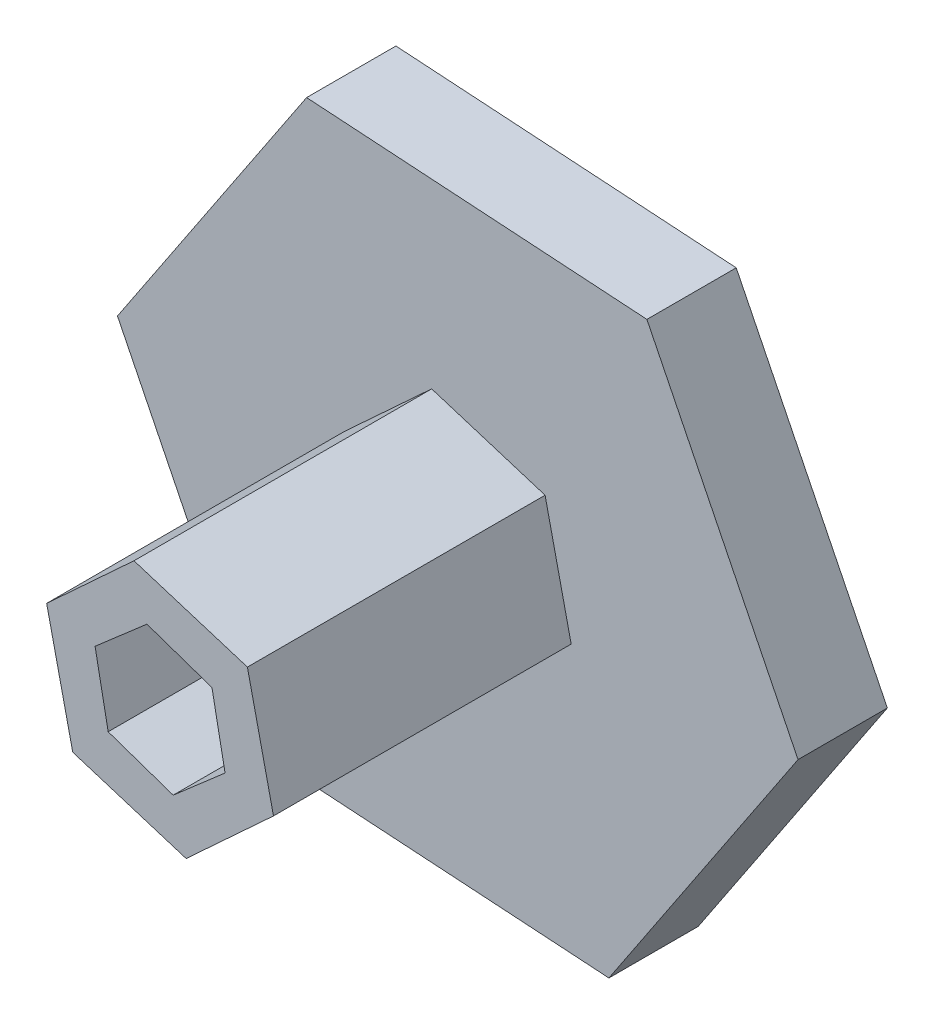
ISO-10303-21;
HEADER;
FILE_DESCRIPTION(('STEP AP214'),'2;1');
FILE_NAME('part.step','',(''),(''),'','','');
FILE_SCHEMA(('AUTOMOTIVE_DESIGN { 1 0 10303 214 1 1 1 1 }'));
ENDSEC;
DATA;
#1=APPLICATION_CONTEXT('core data for automotive mechanical design processes');
#2=APPLICATION_PROTOCOL_DEFINITION('international standard','automotive_design',2000,#1);
#3=PRODUCT_CONTEXT('',#1,'mechanical');
#4=PRODUCT('Part','Part','',(#3));
#5=PRODUCT_RELATED_PRODUCT_CATEGORY('part','',(#4));
#6=PRODUCT_DEFINITION_FORMATION('','',#4);
#7=PRODUCT_DEFINITION_CONTEXT('part definition',#1,'design');
#8=PRODUCT_DEFINITION('design','',#6,#7);
#9=PRODUCT_DEFINITION_SHAPE('','',#8);
#10=(LENGTH_UNIT() NAMED_UNIT(*) SI_UNIT(.MILLI.,.METRE.));
#11=(NAMED_UNIT(*) PLANE_ANGLE_UNIT() SI_UNIT($,.RADIAN.));
#12=(NAMED_UNIT(*) SI_UNIT($,.STERADIAN.) SOLID_ANGLE_UNIT());
#13=UNCERTAINTY_MEASURE_WITH_UNIT(LENGTH_MEASURE(1.E-05),#10,'distance_accuracy_value','');
#14=(GEOMETRIC_REPRESENTATION_CONTEXT(3) GLOBAL_UNCERTAINTY_ASSIGNED_CONTEXT((#13)) GLOBAL_UNIT_ASSIGNED_CONTEXT((#10,
#11,#12)) REPRESENTATION_CONTEXT('',''));
#15=CARTESIAN_POINT('',(0.,0.,0.));
#16=DIRECTION('',(0.,0.,1.));
#17=DIRECTION('',(1.,0.,0.));
#18=AXIS2_PLACEMENT_3D('',#15,#16,#17);
#19=CARTESIAN_POINT('',(4.98689864421293,0.968112551487275,-7.62));
#20=DIRECTION('',(0.981672961459239,0.190573336906944,0.));
#21=DIRECTION('',(-0.190573336906944,0.981672961459239,0.));
#22=AXIS2_PLACEMENT_3D('',#19,#20,#21);
#23=PLANE('',#22);
#24=DIRECTION('',(0.190573336906933,-0.981672961459241,0.));
#25=VECTOR('',#24,1.);
#26=CARTESIAN_POINT('',(4.42795860200594,3.84729982614494,0.));
#27=LINE('',#26,#25);
#28=CARTESIAN_POINT('',(4.4279586020059,3.84729982614499,0.));
#29=VERTEX_POINT('',#28);
#30=CARTESIAN_POINT('',(5.54583868641994,-1.9110747231705,0.));
#31=VERTEX_POINT('',#30);
#32=EDGE_CURVE('E182',#29,#31,#27,.T.);
#33=ORIENTED_EDGE('',*,*,#32,.T.);
#34=DIRECTION('',(0.,0.,1.));
#35=VECTOR('',#34,1.);
#36=CARTESIAN_POINT('',(5.54583868641997,-1.91107472317044,-7.62));
#37=LINE('',#36,#35);
#38=CARTESIAN_POINT('',(5.54583868641997,-1.91107472317044,25.4));
#39=VERTEX_POINT('',#38);
#40=EDGE_CURVE('E166',#31,#39,#37,.T.);
#41=ORIENTED_EDGE('',*,*,#40,.T.);
#42=DIRECTION('',(-0.190573336906944,0.981672961459239,0.));
#43=VECTOR('',#42,1.);
#44=CARTESIAN_POINT('',(4.98689864421293,0.968112551487275,25.4));
#45=LINE('',#44,#43);
#46=CARTESIAN_POINT('',(4.4279586020059,3.84729982614499,25.4));
#47=VERTEX_POINT('',#46);
#48=EDGE_CURVE('E200',#39,#47,#45,.T.);
#49=ORIENTED_EDGE('',*,*,#48,.T.);
#50=DIRECTION('',(0.,0.,1.));
#51=VECTOR('',#50,1.);
#52=CARTESIAN_POINT('',(4.4279586020059,3.84729982614499,-7.62));
#53=LINE('',#52,#51);
#54=EDGE_CURVE('E183',#29,#47,#53,.T.);
#55=ORIENTED_EDGE('',*,*,#54,.F.);
#56=EDGE_LOOP('',(#33,#41,#49,#55));
#57=FACE_BOUND('',#56,.T.);
#58=ADVANCED_FACE('F39',(#57),#23,.F.);
#59=CARTESIAN_POINT('',(1.65503925879592,4.80283718773021,-7.62));
#60=DIRECTION('',(0.325795129684236,0.945440391285475,0.));
#61=DIRECTION('',(-0.945440391285475,0.325795129684236,0.));
#62=AXIS2_PLACEMENT_3D('',#59,#60,#61);
#63=PLANE('',#62);
#64=DIRECTION('',(0.945440391285471,-0.325795129684245,0.));
#65=VECTOR('',#64,1.);
#66=CARTESIAN_POINT('',(-1.11788008441401,5.75837454931544,0.));
#67=LINE('',#66,#65);
#68=CARTESIAN_POINT('',(-1.11788008441407,5.75837454931544,0.));
#69=VERTEX_POINT('',#68);
#70=EDGE_CURVE('E57',#69,#29,#67,.T.);
#71=ORIENTED_EDGE('',*,*,#70,.T.);
#72=ORIENTED_EDGE('',*,*,#54,.T.);
#73=DIRECTION('',(-0.945440391285475,0.325795129684236,0.));
#74=VECTOR('',#73,1.);
#75=CARTESIAN_POINT('',(1.65503925879592,4.80283718773021,25.4));
#76=LINE('',#75,#74);
#77=CARTESIAN_POINT('',(-1.11788008441407,5.75837454931544,25.4));
#78=VERTEX_POINT('',#77);
#79=EDGE_CURVE('E217',#47,#78,#76,.T.);
#80=ORIENTED_EDGE('',*,*,#79,.T.);
#81=DIRECTION('',(0.,0.,1.));
#82=VECTOR('',#81,1.);
#83=CARTESIAN_POINT('',(-1.11788008441407,5.75837454931544,-7.62));
#84=LINE('',#83,#82);
#85=EDGE_CURVE('E265',#69,#78,#84,.T.);
#86=ORIENTED_EDGE('',*,*,#85,.F.);
#87=EDGE_LOOP('',(#71,#72,#80,#86));
#88=FACE_BOUND('',#87,.T.);
#89=ADVANCED_FACE('F393',(#88),#63,.F.);
#90=CARTESIAN_POINT('',(-3.33185938541702,3.83472463624293,-7.62));
#91=DIRECTION('',(-0.655877831775004,0.754867054378531,0.));
#92=DIRECTION('',(-0.754867054378531,-0.655877831775004,0.));
#93=AXIS2_PLACEMENT_3D('',#90,#91,#92);
#94=PLANE('',#93);
#95=DIRECTION('',(0.754867054378538,0.655877831774995,0.));
#96=VECTOR('',#95,1.);
#97=CARTESIAN_POINT('',(-5.54583868641995,1.9110747231705,0.));
#98=LINE('',#97,#96);
#99=CARTESIAN_POINT('',(-5.54583868641997,1.91107472317044,0.));
#100=VERTEX_POINT('',#99);
#101=EDGE_CURVE('E65',#100,#69,#98,.T.);
#102=ORIENTED_EDGE('',*,*,#101,.T.);
#103=ORIENTED_EDGE('',*,*,#85,.T.);
#104=DIRECTION('',(-0.754867054378531,-0.655877831775004,0.));
#105=VECTOR('',#104,1.);
#106=CARTESIAN_POINT('',(-3.33185938541702,3.83472463624293,25.4));
#107=LINE('',#106,#105);
#108=CARTESIAN_POINT('',(-5.54583868641997,1.91107472317044,25.4));
#109=VERTEX_POINT('',#108);
#110=EDGE_CURVE('E213',#78,#109,#107,.T.);
#111=ORIENTED_EDGE('',*,*,#110,.T.);
#112=DIRECTION('',(0.,0.,1.));
#113=VECTOR('',#112,1.);
#114=CARTESIAN_POINT('',(-5.54583868641997,1.91107472317044,-7.62));
#115=LINE('',#114,#113);
#116=EDGE_CURVE('E268',#100,#109,#115,.T.);
#117=ORIENTED_EDGE('',*,*,#116,.F.);
#118=EDGE_LOOP('',(#102,#103,#111,#117));
#119=FACE_BOUND('',#118,.T.);
#120=ADVANCED_FACE('F398',(#119),#94,.F.);
#121=CARTESIAN_POINT('',(-4.98689864421293,-0.968112551487275,-7.62));
#122=DIRECTION('',(-0.981672961459239,-0.190573336906944,0.));
#123=DIRECTION('',(0.190573336906944,-0.981672961459239,0.));
#124=AXIS2_PLACEMENT_3D('',#121,#122,#123);
#125=PLANE('',#124);
#126=DIRECTION('',(-0.190573336906933,0.981672961459241,0.));
#127=VECTOR('',#126,1.);
#128=CARTESIAN_POINT('',(-4.42795860200594,-3.84729982614495,0.));
#129=LINE('',#128,#127);
#130=CARTESIAN_POINT('',(-4.4279586020059,-3.84729982614499,0.));
#131=VERTEX_POINT('',#130);
#132=EDGE_CURVE('E194',#131,#100,#129,.T.);
#133=ORIENTED_EDGE('',*,*,#132,.T.);
#134=ORIENTED_EDGE('',*,*,#116,.T.);
#135=DIRECTION('',(0.190573336906944,-0.981672961459239,0.));
#136=VECTOR('',#135,1.);
#137=CARTESIAN_POINT('',(-4.98689864421293,-0.968112551487275,25.4));
#138=LINE('',#137,#136);
#139=CARTESIAN_POINT('',(-4.4279586020059,-3.84729982614499,25.4));
#140=VERTEX_POINT('',#139);
#141=EDGE_CURVE('E209',#109,#140,#138,.T.);
#142=ORIENTED_EDGE('',*,*,#141,.T.);
#143=DIRECTION('',(0.,0.,1.));
#144=VECTOR('',#143,1.);
#145=CARTESIAN_POINT('',(-4.4279586020059,-3.84729982614499,-7.62));
#146=LINE('',#145,#144);
#147=EDGE_CURVE('E271',#131,#140,#146,.T.);
#148=ORIENTED_EDGE('',*,*,#147,.F.);
#149=EDGE_LOOP('',(#133,#134,#142,#148));
#150=FACE_BOUND('',#149,.T.);
#151=ADVANCED_FACE('F449',(#150),#125,.F.);
#152=CARTESIAN_POINT('',(-1.65503925879592,-4.80283718773021,-7.62));
#153=DIRECTION('',(-0.325795129684235,-0.945440391285475,0.));
#154=DIRECTION('',(0.945440391285475,-0.325795129684235,0.));
#155=AXIS2_PLACEMENT_3D('',#152,#153,#154);
#156=PLANE('',#155);
#157=DIRECTION('',(-0.945440391285472,0.325795129684246,0.));
#158=VECTOR('',#157,1.);
#159=CARTESIAN_POINT('',(1.117880084414,-5.75837454931544,0.));
#160=LINE('',#159,#158);
#161=CARTESIAN_POINT('',(1.11788008441407,-5.75837454931544,0.));
#162=VERTEX_POINT('',#161);
#163=EDGE_CURVE('E190',#162,#131,#160,.T.);
#164=ORIENTED_EDGE('',*,*,#163,.T.);
#165=ORIENTED_EDGE('',*,*,#147,.T.);
#166=DIRECTION('',(0.945440391285475,-0.325795129684235,0.));
#167=VECTOR('',#166,1.);
#168=CARTESIAN_POINT('',(-1.65503925879592,-4.80283718773021,25.4));
#169=LINE('',#168,#167);
#170=CARTESIAN_POINT('',(1.11788008441407,-5.75837454931544,25.4));
#171=VERTEX_POINT('',#170);
#172=EDGE_CURVE('E205',#140,#171,#169,.T.);
#173=ORIENTED_EDGE('',*,*,#172,.T.);
#174=DIRECTION('',(0.,0.,1.));
#175=VECTOR('',#174,1.);
#176=CARTESIAN_POINT('',(1.11788008441407,-5.75837454931544,-7.62));
#177=LINE('',#176,#175);
#178=EDGE_CURVE('E178',#162,#171,#177,.T.);
#179=ORIENTED_EDGE('',*,*,#178,.F.);
#180=EDGE_LOOP('',(#164,#165,#173,#179));
#181=FACE_BOUND('',#180,.T.);
#182=ADVANCED_FACE('F451',(#181),#156,.F.);
#183=CARTESIAN_POINT('',(3.33185938541702,-3.83472463624294,-7.62));
#184=DIRECTION('',(0.655877831775004,-0.754867054378531,0.));
#185=DIRECTION('',(0.754867054378531,0.655877831775004,0.));
#186=AXIS2_PLACEMENT_3D('',#183,#184,#185);
#187=PLANE('',#186);
#188=DIRECTION('',(-0.754867054378538,-0.655877831774995,0.));
#189=VECTOR('',#188,1.);
#190=CARTESIAN_POINT('',(5.54583868641994,-1.9110747231705,0.));
#191=LINE('',#190,#189);
#192=EDGE_CURVE('E170',#31,#162,#191,.T.);
#193=ORIENTED_EDGE('',*,*,#192,.T.);
#194=ORIENTED_EDGE('',*,*,#178,.T.);
#195=DIRECTION('',(0.754867054378531,0.655877831775004,0.));
#196=VECTOR('',#195,1.);
#197=CARTESIAN_POINT('',(3.33185938541702,-3.83472463624294,25.4));
#198=LINE('',#197,#196);
#199=EDGE_CURVE('E173',#171,#39,#198,.T.);
#200=ORIENTED_EDGE('',*,*,#199,.T.);
#201=ORIENTED_EDGE('',*,*,#40,.F.);
#202=EDGE_LOOP('',(#193,#194,#200,#201));
#203=FACE_BOUND('',#202,.T.);
#204=ADVANCED_FACE('F168',(#203),#187,.F.);
#205=CARTESIAN_POINT('',(20.9652843551368,-13.9768562367577,-7.62));
#206=DIRECTION('',(0.832050294337847,-0.554700196225225,0.));
#207=DIRECTION('',(0.554700196225225,0.832050294337847,0.));
#208=AXIS2_PLACEMENT_3D('',#205,#206,#207);
#209=PLANE('',#208);
#210=DIRECTION('',(0.554700196225225,0.832050294337847,0.));
#211=VECTOR('',#210,1.);
#212=CARTESIAN_POINT('',(20.9652843551368,-13.9768562367577,0.));
#213=LINE('',#212,#211);
#214=CARTESIAN_POINT('',(12.8957426444201,-26.081168802833,0.));
#215=VERTEX_POINT('',#214);
#216=CARTESIAN_POINT('',(29.0348260658536,-1.87254367068243,0.));
#217=VERTEX_POINT('',#216);
#218=EDGE_CURVE('E324',#215,#217,#213,.T.);
#219=ORIENTED_EDGE('',*,*,#218,.F.);
#220=DIRECTION('',(0.,0.,1.));
#221=VECTOR('',#220,1.);
#222=CARTESIAN_POINT('',(12.8957426444201,-26.081168802833,-7.62));
#223=LINE('',#222,#221);
#224=CARTESIAN_POINT('',(12.8957426444201,-26.081168802833,-7.62));
#225=VERTEX_POINT('',#224);
#226=EDGE_CURVE('E11',#225,#215,#223,.T.);
#227=ORIENTED_EDGE('',*,*,#226,.F.);
#228=DIRECTION('',(0.554700196225225,0.832050294337847,0.));
#229=VECTOR('',#228,1.);
#230=CARTESIAN_POINT('',(20.9652843551368,-13.9768562367577,-7.62));
#231=LINE('',#230,#229);
#232=CARTESIAN_POINT('',(29.0348260658536,-1.87254367068243,-7.62));
#233=VERTEX_POINT('',#232);
#234=EDGE_CURVE('E276',#225,#233,#231,.T.);
#235=ORIENTED_EDGE('',*,*,#234,.T.);
#236=DIRECTION('',(0.,0.,1.));
#237=VECTOR('',#236,1.);
#238=CARTESIAN_POINT('',(29.0348260658536,-1.87254367068243,-7.62));
#239=LINE('',#238,#237);
#240=EDGE_CURVE('E43',#233,#217,#239,.T.);
#241=ORIENTED_EDGE('',*,*,#240,.T.);
#242=EDGE_LOOP('',(#219,#227,#235,#241));
#243=FACE_BOUND('',#242,.T.);
#244=ADVANCED_FACE('F41',(#243),#209,.T.);
#245=CARTESIAN_POINT('',(-1.62167038850674,-25.1448969674918,-7.62));
#246=DIRECTION('',(-0.0643593142463341,-0.997926790235507,0.));
#247=DIRECTION('',(0.997926790235507,-0.0643593142463341,0.));
#248=AXIS2_PLACEMENT_3D('',#245,#246,#247);
#249=PLANE('',#248);
#250=DIRECTION('',(0.997926790235507,-0.064359314246334,0.));
#251=VECTOR('',#250,1.);
#252=CARTESIAN_POINT('',(-1.62167038850674,-25.1448969674918,0.));
#253=LINE('',#252,#251);
#254=CARTESIAN_POINT('',(-16.1390834214335,-24.2086251321506,0.));
#255=VERTEX_POINT('',#254);
#256=EDGE_CURVE('E281',#255,#215,#253,.T.);
#257=ORIENTED_EDGE('',*,*,#256,.F.);
#258=DIRECTION('',(0.,0.,1.));
#259=VECTOR('',#258,1.);
#260=CARTESIAN_POINT('',(-16.1390834214335,-24.2086251321506,-7.62));
#261=LINE('',#260,#259);
#262=CARTESIAN_POINT('',(-16.1390834214335,-24.2086251321506,-7.62));
#263=VERTEX_POINT('',#262);
#264=EDGE_CURVE('E49',#263,#255,#261,.T.);
#265=ORIENTED_EDGE('',*,*,#264,.F.);
#266=DIRECTION('',(0.997926790235507,-0.064359314246334,0.));
#267=VECTOR('',#266,1.);
#268=CARTESIAN_POINT('',(-1.62167038850674,-25.1448969674918,-7.62));
#269=LINE('',#268,#267);
#270=EDGE_CURVE('E297',#263,#225,#269,.T.);
#271=ORIENTED_EDGE('',*,*,#270,.T.);
#272=ORIENTED_EDGE('',*,*,#226,.T.);
#273=EDGE_LOOP('',(#257,#265,#271,#272));
#274=FACE_BOUND('',#273,.T.);
#275=ADVANCED_FACE('F370',(#274),#249,.T.);
#276=CARTESIAN_POINT('',(-22.5869547436436,-11.1680407307341,-7.62));
#277=DIRECTION('',(-0.896409608584181,-0.443226594010282,0.));
#278=DIRECTION('',(0.443226594010282,-0.896409608584181,0.));
#279=AXIS2_PLACEMENT_3D('',#276,#277,#278);
#280=PLANE('',#279);
#281=DIRECTION('',(0.443226594010282,-0.896409608584181,0.));
#282=VECTOR('',#281,1.);
#283=CARTESIAN_POINT('',(-22.5869547436436,-11.1680407307341,0.));
#284=LINE('',#283,#282);
#285=CARTESIAN_POINT('',(-29.0348260658536,1.87254367068243,0.));
#286=VERTEX_POINT('',#285);
#287=EDGE_CURVE('E340',#286,#255,#284,.T.);
#288=ORIENTED_EDGE('',*,*,#287,.F.);
#289=DIRECTION('',(0.,0.,1.));
#290=VECTOR('',#289,1.);
#291=CARTESIAN_POINT('',(-29.0348260658536,1.87254367068243,-7.62));
#292=LINE('',#291,#290);
#293=CARTESIAN_POINT('',(-29.0348260658536,1.87254367068243,-7.62));
#294=VERTEX_POINT('',#293);
#295=EDGE_CURVE('E349',#294,#286,#292,.T.);
#296=ORIENTED_EDGE('',*,*,#295,.F.);
#297=DIRECTION('',(0.443226594010282,-0.896409608584181,0.));
#298=VECTOR('',#297,1.);
#299=CARTESIAN_POINT('',(-22.5869547436436,-11.1680407307341,-7.62));
#300=LINE('',#299,#298);
#301=EDGE_CURVE('E293',#294,#263,#300,.T.);
#302=ORIENTED_EDGE('',*,*,#301,.T.);
#303=ORIENTED_EDGE('',*,*,#264,.T.);
#304=EDGE_LOOP('',(#288,#296,#302,#303));
#305=FACE_BOUND('',#304,.T.);
#306=ADVANCED_FACE('F383',(#305),#280,.T.);
#307=CARTESIAN_POINT('',(-20.9652843551368,13.9768562367577,-7.62));
#308=DIRECTION('',(-0.832050294337847,0.554700196225224,0.));
#309=DIRECTION('',(-0.554700196225224,-0.832050294337847,0.));
#310=AXIS2_PLACEMENT_3D('',#307,#308,#309);
#311=PLANE('',#310);
#312=DIRECTION('',(-0.554700196225224,-0.832050294337847,0.));
#313=VECTOR('',#312,1.);
#314=CARTESIAN_POINT('',(-20.9652843551368,13.9768562367577,0.));
#315=LINE('',#314,#313);
#316=CARTESIAN_POINT('',(-12.8957426444201,26.081168802833,0.));
#317=VERTEX_POINT('',#316);
#318=EDGE_CURVE('E336',#317,#286,#315,.T.);
#319=ORIENTED_EDGE('',*,*,#318,.F.);
#320=DIRECTION('',(0.,0.,1.));
#321=VECTOR('',#320,1.);
#322=CARTESIAN_POINT('',(-12.8957426444201,26.081168802833,-7.62));
#323=LINE('',#322,#321);
#324=CARTESIAN_POINT('',(-12.8957426444201,26.081168802833,-7.62));
#325=VERTEX_POINT('',#324);
#326=EDGE_CURVE('E352',#325,#317,#323,.T.);
#327=ORIENTED_EDGE('',*,*,#326,.F.);
#328=DIRECTION('',(-0.554700196225224,-0.832050294337847,0.));
#329=VECTOR('',#328,1.);
#330=CARTESIAN_POINT('',(-20.9652843551368,13.9768562367577,-7.62));
#331=LINE('',#330,#329);
#332=EDGE_CURVE('E289',#325,#294,#331,.T.);
#333=ORIENTED_EDGE('',*,*,#332,.T.);
#334=ORIENTED_EDGE('',*,*,#295,.T.);
#335=EDGE_LOOP('',(#319,#327,#333,#334));
#336=FACE_BOUND('',#335,.T.);
#337=ADVANCED_FACE('F381',(#336),#311,.T.);
#338=CARTESIAN_POINT('',(1.62167038850674,25.1448969674918,-7.62));
#339=DIRECTION('',(0.0643593142463341,0.997926790235507,0.));
#340=DIRECTION('',(-0.997926790235507,0.0643593142463341,0.));
#341=AXIS2_PLACEMENT_3D('',#338,#339,#340);
#342=PLANE('',#341);
#343=DIRECTION('',(-0.997926790235507,0.0643593142463341,0.));
#344=VECTOR('',#343,1.);
#345=CARTESIAN_POINT('',(1.62167038850674,25.1448969674918,0.));
#346=LINE('',#345,#344);
#347=CARTESIAN_POINT('',(16.1390834214335,24.2086251321506,0.));
#348=VERTEX_POINT('',#347);
#349=EDGE_CURVE('E332',#348,#317,#346,.T.);
#350=ORIENTED_EDGE('',*,*,#349,.F.);
#351=DIRECTION('',(0.,0.,1.));
#352=VECTOR('',#351,1.);
#353=CARTESIAN_POINT('',(16.1390834214335,24.2086251321506,-7.62));
#354=LINE('',#353,#352);
#355=CARTESIAN_POINT('',(16.1390834214335,24.2086251321506,-7.62));
#356=VERTEX_POINT('',#355);
#357=EDGE_CURVE('E354',#356,#348,#354,.T.);
#358=ORIENTED_EDGE('',*,*,#357,.F.);
#359=DIRECTION('',(-0.997926790235507,0.0643593142463341,0.));
#360=VECTOR('',#359,1.);
#361=CARTESIAN_POINT('',(1.62167038850674,25.1448969674918,-7.62));
#362=LINE('',#361,#360);
#363=EDGE_CURVE('E285',#356,#325,#362,.T.);
#364=ORIENTED_EDGE('',*,*,#363,.T.);
#365=ORIENTED_EDGE('',*,*,#326,.T.);
#366=EDGE_LOOP('',(#350,#358,#364,#365));
#367=FACE_BOUND('',#366,.T.);
#368=ADVANCED_FACE('F378',(#367),#342,.T.);
#369=CARTESIAN_POINT('',(22.5869547436436,11.1680407307341,-7.62));
#370=DIRECTION('',(0.896409608584181,0.443226594010282,0.));
#371=DIRECTION('',(-0.443226594010283,0.896409608584181,0.));
#372=AXIS2_PLACEMENT_3D('',#369,#370,#371);
#373=PLANE('',#372);
#374=DIRECTION('',(-0.443226594010282,0.896409608584181,0.));
#375=VECTOR('',#374,1.);
#376=CARTESIAN_POINT('',(22.5869547436436,11.1680407307341,0.));
#377=LINE('',#376,#375);
#378=EDGE_CURVE('E328',#217,#348,#377,.T.);
#379=ORIENTED_EDGE('',*,*,#378,.F.);
#380=ORIENTED_EDGE('',*,*,#240,.F.);
#381=DIRECTION('',(-0.443226594010282,0.896409608584181,0.));
#382=VECTOR('',#381,1.);
#383=CARTESIAN_POINT('',(22.5869547436436,11.1680407307341,-7.62));
#384=LINE('',#383,#382);
#385=EDGE_CURVE('E280',#233,#356,#384,.T.);
#386=ORIENTED_EDGE('',*,*,#385,.T.);
#387=ORIENTED_EDGE('',*,*,#357,.T.);
#388=EDGE_LOOP('',(#379,#380,#386,#387));
#389=FACE_BOUND('',#388,.T.);
#390=ADVANCED_FACE('F364',(#389),#373,.T.);
#391=CARTESIAN_POINT('',(0.,0.,-7.62));
#392=DIRECTION('',(0.,0.,1.));
#393=DIRECTION('',(1.,0.,0.));
#394=AXIS2_PLACEMENT_3D('',#391,#392,#393);
#395=PLANE('',#394);
#396=ORIENTED_EDGE('',*,*,#234,.F.);
#397=ORIENTED_EDGE('',*,*,#270,.F.);
#398=ORIENTED_EDGE('',*,*,#301,.F.);
#399=ORIENTED_EDGE('',*,*,#332,.F.);
#400=ORIENTED_EDGE('',*,*,#363,.F.);
#401=ORIENTED_EDGE('',*,*,#385,.F.);
#402=EDGE_LOOP('',(#396,#397,#398,#399,#400,#401));
#403=FACE_BOUND('',#402,.T.);
#404=ADVANCED_FACE('F373',(#403),#395,.F.);
#405=CARTESIAN_POINT('',(0.,0.,0.));
#406=DIRECTION('',(0.,0.,1.));
#407=DIRECTION('',(1.,0.,0.));
#408=AXIS2_PLACEMENT_3D('',#405,#406,#407);
#409=PLANE('',#408);
#410=DIRECTION('',(-0.219595080223075,0.97559110325065,0.));
#411=VECTOR('',#410,1.);
#412=CARTESIAN_POINT('',(8.56426621750781,1.92772435174844,0.));
#413=LINE('',#412,#411);
#414=CARTESIAN_POINT('',(9.67723839091317,-3.01685705434132,0.));
#415=VERTEX_POINT('',#414);
#416=CARTESIAN_POINT('',(7.45129404410245,6.87230575783819,0.));
#417=VERTEX_POINT('',#416);
#418=EDGE_CURVE('E247',#415,#417,#413,.T.);
#419=ORIENTED_EDGE('',*,*,#418,.F.);
#420=DIRECTION('',(0.735089139009613,0.67797046964459,0.));
#421=VECTOR('',#420,1.);
#422=CARTESIAN_POINT('',(5.95159136886194,-6.45300993326041,0.));
#423=LINE('',#422,#421);
#424=CARTESIAN_POINT('',(2.22594434681071,-9.8891628121795,0.));
#425=VERTEX_POINT('',#424);
#426=EDGE_CURVE('E304',#425,#415,#423,.T.);
#427=ORIENTED_EDGE('',*,*,#426,.F.);
#428=DIRECTION('',(0.954684219232688,-0.29762063360606,0.));
#429=VECTOR('',#428,1.);
#430=CARTESIAN_POINT('',(-2.61267484864587,-8.38073428500885,0.));
#431=LINE('',#430,#429);
#432=CARTESIAN_POINT('',(-7.45129404410245,-6.87230575783819,0.));
#433=VERTEX_POINT('',#432);
#434=EDGE_CURVE('E308',#433,#425,#431,.T.);
#435=ORIENTED_EDGE('',*,*,#434,.F.);
#436=DIRECTION('',(0.219595080223076,-0.97559110325065,0.));
#437=VECTOR('',#436,1.);
#438=CARTESIAN_POINT('',(-8.56426621750781,-1.92772435174844,0.));
#439=LINE('',#438,#437);
#440=CARTESIAN_POINT('',(-9.67723839091316,3.01685705434131,0.));
#441=VERTEX_POINT('',#440);
#442=EDGE_CURVE('E312',#441,#433,#439,.T.);
#443=ORIENTED_EDGE('',*,*,#442,.F.);
#444=DIRECTION('',(-0.735089139009613,-0.67797046964459,0.));
#445=VECTOR('',#444,1.);
#446=CARTESIAN_POINT('',(-5.95159136886194,6.45300993326041,0.));
#447=LINE('',#446,#445);
#448=CARTESIAN_POINT('',(-2.22594434681071,9.8891628121795,0.));
#449=VERTEX_POINT('',#448);
#450=EDGE_CURVE('E316',#449,#441,#447,.T.);
#451=ORIENTED_EDGE('',*,*,#450,.F.);
#452=DIRECTION('',(-0.954684219232688,0.29762063360606,0.));
#453=VECTOR('',#452,1.);
#454=CARTESIAN_POINT('',(2.61267484864587,8.38073428500885,0.));
#455=LINE('',#454,#453);
#456=EDGE_CURVE('E320',#417,#449,#455,.T.);
#457=ORIENTED_EDGE('',*,*,#456,.F.);
#458=EDGE_LOOP('',(#419,#427,#435,#443,#451,#457));
#459=FACE_BOUND('',#458,.T.);
#460=ORIENTED_EDGE('',*,*,#218,.T.);
#461=ORIENTED_EDGE('',*,*,#378,.T.);
#462=ORIENTED_EDGE('',*,*,#349,.T.);
#463=ORIENTED_EDGE('',*,*,#318,.T.);
#464=ORIENTED_EDGE('',*,*,#287,.T.);
#465=ORIENTED_EDGE('',*,*,#256,.T.);
#466=EDGE_LOOP('',(#460,#461,#462,#463,#464,#465));
#467=FACE_BOUND('',#466,.T.);
#468=ADVANCED_FACE('F366',(#459,#467),#409,.T.);
#469=CARTESIAN_POINT('',(5.95159136886194,-6.45300993326041,-7.62));
#470=DIRECTION('',(0.67797046964459,-0.735089139009613,0.));
#471=DIRECTION('',(0.735089139009613,0.67797046964459,0.));
#472=AXIS2_PLACEMENT_3D('',#469,#470,#471);
#473=PLANE('',#472);
#474=DIRECTION('',(0.,0.,1.));
#475=VECTOR('',#474,1.);
#476=CARTESIAN_POINT('',(2.22594434681071,-9.8891628121795,-7.62));
#477=LINE('',#476,#475);
#478=CARTESIAN_POINT('',(2.22594434681071,-9.8891628121795,25.4));
#479=VERTEX_POINT('',#478);
#480=EDGE_CURVE('E244',#425,#479,#477,.T.);
#481=ORIENTED_EDGE('',*,*,#480,.F.);
#482=ORIENTED_EDGE('',*,*,#426,.T.);
#483=DIRECTION('',(0.,0.,1.));
#484=VECTOR('',#483,1.);
#485=CARTESIAN_POINT('',(9.67723839091317,-3.01685705434132,-7.62));
#486=LINE('',#485,#484);
#487=CARTESIAN_POINT('',(9.67723839091317,-3.01685705434132,25.4));
#488=VERTEX_POINT('',#487);
#489=EDGE_CURVE('E260',#415,#488,#486,.T.);
#490=ORIENTED_EDGE('',*,*,#489,.T.);
#491=DIRECTION('',(0.735089139009613,0.67797046964459,0.));
#492=VECTOR('',#491,1.);
#493=CARTESIAN_POINT('',(5.95159136886194,-6.45300993326041,25.4));
#494=LINE('',#493,#492);
#495=EDGE_CURVE('E221',#479,#488,#494,.T.);
#496=ORIENTED_EDGE('',*,*,#495,.F.);
#497=EDGE_LOOP('',(#481,#482,#490,#496));
#498=FACE_BOUND('',#497,.T.);
#499=ADVANCED_FACE('F406',(#498),#473,.T.);
#500=CARTESIAN_POINT('',(-2.61267484864587,-8.38073428500885,-7.62));
#501=DIRECTION('',(-0.29762063360606,-0.954684219232688,0.));
#502=DIRECTION('',(0.954684219232688,-0.29762063360606,0.));
#503=AXIS2_PLACEMENT_3D('',#500,#501,#502);
#504=PLANE('',#503);
#505=DIRECTION('',(0.,0.,1.));
#506=VECTOR('',#505,1.);
#507=CARTESIAN_POINT('',(-7.45129404410245,-6.87230575783819,-7.62));
#508=LINE('',#507,#506);
#509=CARTESIAN_POINT('',(-7.45129404410245,-6.87230575783819,25.4));
#510=VERTEX_POINT('',#509);
#511=EDGE_CURVE('E248',#433,#510,#508,.T.);
#512=ORIENTED_EDGE('',*,*,#511,.F.);
#513=ORIENTED_EDGE('',*,*,#434,.T.);
#514=ORIENTED_EDGE('',*,*,#480,.T.);
#515=DIRECTION('',(0.954684219232688,-0.29762063360606,0.));
#516=VECTOR('',#515,1.);
#517=CARTESIAN_POINT('',(-2.61267484864587,-8.38073428500885,25.4));
#518=LINE('',#517,#516);
#519=EDGE_CURVE('E179',#510,#479,#518,.T.);
#520=ORIENTED_EDGE('',*,*,#519,.F.);
#521=EDGE_LOOP('',(#512,#513,#514,#520));
#522=FACE_BOUND('',#521,.T.);
#523=ADVANCED_FACE('F411',(#522),#504,.T.);
#524=CARTESIAN_POINT('',(-8.56426621750781,-1.92772435174844,-7.62));
#525=DIRECTION('',(-0.97559110325065,-0.219595080223076,0.));
#526=DIRECTION('',(0.219595080223076,-0.97559110325065,0.));
#527=AXIS2_PLACEMENT_3D('',#524,#525,#526);
#528=PLANE('',#527);
#529=DIRECTION('',(0.,0.,1.));
#530=VECTOR('',#529,1.);
#531=CARTESIAN_POINT('',(-9.67723839091316,3.01685705434131,-7.62));
#532=LINE('',#531,#530);
#533=CARTESIAN_POINT('',(-9.67723839091316,3.01685705434131,25.4));
#534=VERTEX_POINT('',#533);
#535=EDGE_CURVE('E251',#441,#534,#532,.T.);
#536=ORIENTED_EDGE('',*,*,#535,.F.);
#537=ORIENTED_EDGE('',*,*,#442,.T.);
#538=ORIENTED_EDGE('',*,*,#511,.T.);
#539=DIRECTION('',(0.219595080223076,-0.97559110325065,0.));
#540=VECTOR('',#539,1.);
#541=CARTESIAN_POINT('',(-8.56426621750781,-1.92772435174844,25.4));
#542=LINE('',#541,#540);
#543=EDGE_CURVE('E237',#534,#510,#542,.T.);
#544=ORIENTED_EDGE('',*,*,#543,.F.);
#545=EDGE_LOOP('',(#536,#537,#538,#544));
#546=FACE_BOUND('',#545,.T.);
#547=ADVANCED_FACE('F430',(#546),#528,.T.);
#548=CARTESIAN_POINT('',(-5.95159136886194,6.45300993326041,-7.62));
#549=DIRECTION('',(-0.67797046964459,0.735089139009613,0.));
#550=DIRECTION('',(-0.735089139009613,-0.67797046964459,0.));
#551=AXIS2_PLACEMENT_3D('',#548,#549,#550);
#552=PLANE('',#551);
#553=DIRECTION('',(0.,0.,1.));
#554=VECTOR('',#553,1.);
#555=CARTESIAN_POINT('',(-2.22594434681071,9.8891628121795,-7.62));
#556=LINE('',#555,#554);
#557=CARTESIAN_POINT('',(-2.22594434681071,9.8891628121795,25.4));
#558=VERTEX_POINT('',#557);
#559=EDGE_CURVE('E254',#449,#558,#556,.T.);
#560=ORIENTED_EDGE('',*,*,#559,.F.);
#561=ORIENTED_EDGE('',*,*,#450,.T.);
#562=ORIENTED_EDGE('',*,*,#535,.T.);
#563=DIRECTION('',(-0.735089139009613,-0.67797046964459,0.));
#564=VECTOR('',#563,1.);
#565=CARTESIAN_POINT('',(-5.95159136886194,6.45300993326041,25.4));
#566=LINE('',#565,#564);
#567=EDGE_CURVE('E233',#558,#534,#566,.T.);
#568=ORIENTED_EDGE('',*,*,#567,.F.);
#569=EDGE_LOOP('',(#560,#561,#562,#568));
#570=FACE_BOUND('',#569,.T.);
#571=ADVANCED_FACE('F434',(#570),#552,.T.);
#572=CARTESIAN_POINT('',(2.61267484864587,8.38073428500885,-7.62));
#573=DIRECTION('',(0.29762063360606,0.954684219232688,0.));
#574=DIRECTION('',(-0.954684219232688,0.29762063360606,0.));
#575=AXIS2_PLACEMENT_3D('',#572,#573,#574);
#576=PLANE('',#575);
#577=DIRECTION('',(0.,0.,1.));
#578=VECTOR('',#577,1.);
#579=CARTESIAN_POINT('',(7.45129404410245,6.87230575783819,-7.62));
#580=LINE('',#579,#578);
#581=CARTESIAN_POINT('',(7.45129404410245,6.87230575783819,25.4));
#582=VERTEX_POINT('',#581);
#583=EDGE_CURVE('E257',#417,#582,#580,.T.);
#584=ORIENTED_EDGE('',*,*,#583,.F.);
#585=ORIENTED_EDGE('',*,*,#456,.T.);
#586=ORIENTED_EDGE('',*,*,#559,.T.);
#587=DIRECTION('',(-0.954684219232688,0.29762063360606,0.));
#588=VECTOR('',#587,1.);
#589=CARTESIAN_POINT('',(2.61267484864587,8.38073428500885,25.4));
#590=LINE('',#589,#588);
#591=EDGE_CURVE('E229',#582,#558,#590,.T.);
#592=ORIENTED_EDGE('',*,*,#591,.F.);
#593=EDGE_LOOP('',(#584,#585,#586,#592));
#594=FACE_BOUND('',#593,.T.);
#595=ADVANCED_FACE('F436',(#594),#576,.T.);
#596=CARTESIAN_POINT('',(8.56426621750781,1.92772435174844,-7.62));
#597=DIRECTION('',(0.97559110325065,0.219595080223075,0.));
#598=DIRECTION('',(-0.219595080223075,0.97559110325065,0.));
#599=AXIS2_PLACEMENT_3D('',#596,#597,#598);
#600=PLANE('',#599);
#601=ORIENTED_EDGE('',*,*,#489,.F.);
#602=ORIENTED_EDGE('',*,*,#418,.T.);
#603=ORIENTED_EDGE('',*,*,#583,.T.);
#604=DIRECTION('',(-0.219595080223075,0.97559110325065,0.));
#605=VECTOR('',#604,1.);
#606=CARTESIAN_POINT('',(8.56426621750781,1.92772435174844,25.4));
#607=LINE('',#606,#605);
#608=EDGE_CURVE('E225',#488,#582,#607,.T.);
#609=ORIENTED_EDGE('',*,*,#608,.F.);
#610=EDGE_LOOP('',(#601,#602,#603,#609));
#611=FACE_BOUND('',#610,.T.);
#612=ADVANCED_FACE('F420',(#611),#600,.T.);
#613=CARTESIAN_POINT('',(0.,0.,25.4));
#614=DIRECTION('',(0.,0.,1.));
#615=DIRECTION('',(1.,0.,0.));
#616=AXIS2_PLACEMENT_3D('',#613,#614,#615);
#617=PLANE('',#616);
#618=ORIENTED_EDGE('',*,*,#48,.F.);
#619=ORIENTED_EDGE('',*,*,#199,.F.);
#620=ORIENTED_EDGE('',*,*,#172,.F.);
#621=ORIENTED_EDGE('',*,*,#141,.F.);
#622=ORIENTED_EDGE('',*,*,#110,.F.);
#623=ORIENTED_EDGE('',*,*,#79,.F.);
#624=EDGE_LOOP('',(#618,#619,#620,#621,#622,#623));
#625=FACE_BOUND('',#624,.T.);
#626=ORIENTED_EDGE('',*,*,#495,.T.);
#627=ORIENTED_EDGE('',*,*,#608,.T.);
#628=ORIENTED_EDGE('',*,*,#591,.T.);
#629=ORIENTED_EDGE('',*,*,#567,.T.);
#630=ORIENTED_EDGE('',*,*,#543,.T.);
#631=ORIENTED_EDGE('',*,*,#519,.T.);
#632=EDGE_LOOP('',(#626,#627,#628,#629,#630,#631));
#633=FACE_BOUND('',#632,.T.);
#634=ADVANCED_FACE('F423',(#625,#633),#617,.T.);
#635=CARTESIAN_POINT('',(0.,0.,0.));
#636=DIRECTION('',(0.,0.,-1.));
#637=DIRECTION('',(-1.,0.,0.));
#638=AXIS2_PLACEMENT_3D('',#635,#636,#637);
#639=PLANE('',#638);
#640=ORIENTED_EDGE('',*,*,#101,.F.);
#641=ORIENTED_EDGE('',*,*,#132,.F.);
#642=ORIENTED_EDGE('',*,*,#163,.F.);
#643=ORIENTED_EDGE('',*,*,#192,.F.);
#644=ORIENTED_EDGE('',*,*,#32,.F.);
#645=ORIENTED_EDGE('',*,*,#70,.F.);
#646=EDGE_LOOP('',(#640,#641,#642,#643,#644,#645));
#647=FACE_BOUND('',#646,.T.);
#648=ADVANCED_FACE('F188',(#647),#639,.F.);
#649=CLOSED_SHELL('',(#58,#89,#120,#151,#182,#204,#244,#275,#306,#337,#368,#390,#404,#468,#499,
#523,#547,#571,#595,#612,#634,#648));
#650=MANIFOLD_SOLID_BREP('B2',#649);
#651=ADVANCED_BREP_SHAPE_REPRESENTATION('',(#18,#650),#14);
#652=SHAPE_DEFINITION_REPRESENTATION(#9,#651);
ENDSEC;
END-ISO-10303-21;
